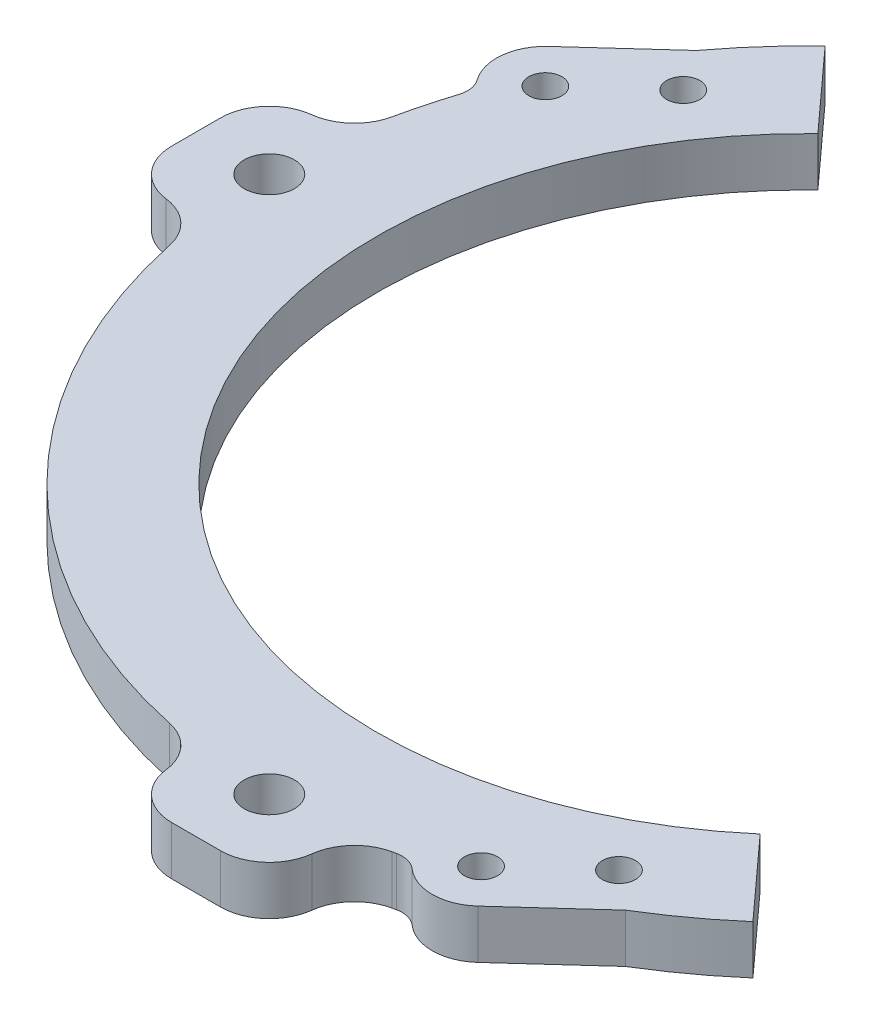
ISO-10303-21;
HEADER;
FILE_DESCRIPTION(('STEP AP214'),'2;1');
FILE_NAME('part.step','',(''),(''),'','','');
FILE_SCHEMA(('AUTOMOTIVE_DESIGN { 1 0 10303 214 1 1 1 1 }'));
ENDSEC;
DATA;
#1=APPLICATION_CONTEXT('core data for automotive mechanical design processes');
#2=APPLICATION_PROTOCOL_DEFINITION('international standard','automotive_design',2000,#1);
#3=PRODUCT_CONTEXT('',#1,'mechanical');
#4=PRODUCT('Part','Part','',(#3));
#5=PRODUCT_RELATED_PRODUCT_CATEGORY('part','',(#4));
#6=PRODUCT_DEFINITION_FORMATION('','',#4);
#7=PRODUCT_DEFINITION_CONTEXT('part definition',#1,'design');
#8=PRODUCT_DEFINITION('design','',#6,#7);
#9=PRODUCT_DEFINITION_SHAPE('','',#8);
#10=(LENGTH_UNIT() NAMED_UNIT(*) SI_UNIT(.MILLI.,.METRE.));
#11=(NAMED_UNIT(*) PLANE_ANGLE_UNIT() SI_UNIT($,.RADIAN.));
#12=(NAMED_UNIT(*) SI_UNIT($,.STERADIAN.) SOLID_ANGLE_UNIT());
#13=UNCERTAINTY_MEASURE_WITH_UNIT(LENGTH_MEASURE(1.E-05),#10,'distance_accuracy_value','');
#14=(GEOMETRIC_REPRESENTATION_CONTEXT(3) GLOBAL_UNCERTAINTY_ASSIGNED_CONTEXT((#13)) GLOBAL_UNIT_ASSIGNED_CONTEXT((#10,
#11,#12)) REPRESENTATION_CONTEXT('',''));
#15=CARTESIAN_POINT('',(0.,0.,0.));
#16=DIRECTION('',(0.,0.,1.));
#17=DIRECTION('',(1.,0.,0.));
#18=AXIS2_PLACEMENT_3D('',#15,#16,#17);
#19=CARTESIAN_POINT('',(0.,6.35,0.));
#20=DIRECTION('',(0.,1.,0.));
#21=DIRECTION('',(0.,0.,1.));
#22=AXIS2_PLACEMENT_3D('',#19,#20,#21);
#23=PLANE('',#22);
#24=CARTESIAN_POINT('',(31.274224331487,6.35,55.6401101119106));
#25=DIRECTION('',(0.,-1.,0.));
#26=DIRECTION('',(0.,0.,-1.));
#27=AXIS2_PLACEMENT_3D('',#24,#25,#26);
#28=CIRCLE('',#27,2.15265);
#29=CARTESIAN_POINT('',(31.274224331487,6.35,53.4874601119106));
#30=VERTEX_POINT('',#29);
#31=EDGE_CURVE('E736',#30,#30,#28,.T.);
#32=ORIENTED_EDGE('',*,*,#31,.T.);
#33=EDGE_LOOP('',(#32));
#34=FACE_BOUND('',#33,.T.);
#35=CARTESIAN_POINT('',(-61.814820817554,6.35,-27.8750674993873));
#36=DIRECTION('',(0.,-1.,0.));
#37=DIRECTION('',(0.,0.,-1.));
#38=AXIS2_PLACEMENT_3D('',#35,#36,#37);
#39=CIRCLE('',#38,2.15265);
#40=CARTESIAN_POINT('',(-61.814820817554,6.35,-30.0277174993873));
#41=VERTEX_POINT('',#40);
#42=EDGE_CURVE('E743',#41,#41,#39,.T.);
#43=ORIENTED_EDGE('',*,*,#42,.T.);
#44=EDGE_LOOP('',(#43));
#45=FACE_BOUND('',#44,.T.);
#46=CARTESIAN_POINT('',(-52.4177142064565,6.35,-36.4181575340099));
#47=DIRECTION('',(0.,-1.,0.));
#48=DIRECTION('',(0.,0.,-1.));
#49=AXIS2_PLACEMENT_3D('',#46,#47,#48);
#50=CIRCLE('',#49,2.15265);
#51=CARTESIAN_POINT('',(-52.4177142064565,6.35,-38.5708075340099));
#52=VERTEX_POINT('',#51);
#53=EDGE_CURVE('E210',#52,#52,#50,.T.);
#54=ORIENTED_EDGE('',*,*,#53,.T.);
#55=EDGE_LOOP('',(#54));
#56=FACE_BOUND('',#55,.T.);
#57=CARTESIAN_POINT('',(0.,6.35,0.));
#58=DIRECTION('',(0.,1.,0.));
#59=DIRECTION('',(0.,0.,1.));
#60=AXIS2_PLACEMENT_3D('',#57,#58,#59);
#61=CIRCLE('',#60,69.85);
#62=CARTESIAN_POINT('',(14.4681299077741,6.35,68.3351718880678));
#63=VERTEX_POINT('',#62);
#64=CARTESIAN_POINT('',(14.9147795723539,6.35,68.2390786156151));
#65=VERTEX_POINT('',#64);
#66=EDGE_CURVE('E419',#63,#65,#61,.T.);
#67=ORIENTED_EDGE('',*,*,#66,.T.);
#68=CARTESIAN_POINT('',(15.59272409837,6.35,71.3408549163249));
#69=DIRECTION('',(0.,1.,0.));
#70=DIRECTION('',(0.,0.,1.));
#71=AXIS2_PLACEMENT_3D('',#68,#69,#70);
#72=CIRCLE('',#71,3.175);
#73=CARTESIAN_POINT('',(17.6875219723765,6.35,68.9549699930609));
#74=VERTEX_POINT('',#73);
#75=EDGE_CURVE('E443',#65,#74,#72,.F.);
#76=ORIENTED_EDGE('',*,*,#75,.T.);
#77=CARTESIAN_POINT('',(21.8771177203895,6.35,64.1832001465331));
#78=DIRECTION('',(0.,1.,0.));
#79=DIRECTION('',(0.,0.,1.));
#80=AXIS2_PLACEMENT_3D('',#77,#78,#79);
#81=CIRCLE('',#80,6.35000000000001);
#82=CARTESIAN_POINT('',(26.1486627377007,6.35,68.8817534520819));
#83=VERTEX_POINT('',#82);
#84=EDGE_CURVE('E221',#83,#74,#81,.F.);
#85=ORIENTED_EDGE('',*,*,#84,.F.);
#86=DIRECTION('',(-0.739929654417129,0.,0.672684254694689));
#87=VECTOR('',#86,1.);
#88=CARTESIAN_POINT('',(44.9428759598958,6.35,51.7955733828368));
#89=LINE('',#88,#87);
#90=CARTESIAN_POINT('',(36.2207197765855,6.35,59.7250530252261));
#91=VERTEX_POINT('',#90);
#92=EDGE_CURVE('E216',#91,#83,#89,.T.);
#93=ORIENTED_EDGE('',*,*,#92,.F.);
#94=CARTESIAN_POINT('',(45.8002202255313,6.35,52.7386227284411));
#95=VERTEX_POINT('',#94);
#96=EDGE_CURVE('E456',#91,#95,#61,.T.);
#97=ORIENTED_EDGE('',*,*,#96,.T.);
#98=DIRECTION('',(0.672684254694688,0.,0.739929654417129));
#99=VECTOR('',#98,1.);
#100=CARTESIAN_POINT('',(-57.4966353212064,6.35,-60.884382557693));
#101=LINE('',#100,#99);
#102=CARTESIAN_POINT('',(36.3997859252733,6.35,42.3984667717393));
#103=VERTEX_POINT('',#102);
#104=EDGE_CURVE('E406',#103,#95,#101,.T.);
#105=ORIENTED_EDGE('',*,*,#104,.F.);
#106=CARTESIAN_POINT('',(0.,6.35,0.));
#107=DIRECTION('',(0.,1.,0.));
#108=DIRECTION('',(0.,0.,1.));
#109=AXIS2_PLACEMENT_3D('',#106,#107,#108);
#110=CIRCLE('',#109,55.88);
#111=CARTESIAN_POINT('',(-38.7490625780477,6.35,-40.2626942630836));
#112=VERTEX_POINT('',#111);
#113=EDGE_CURVE('E265',#112,#103,#110,.T.);
#114=ORIENTED_EDGE('',*,*,#113,.F.);
#115=CARTESIAN_POINT('',(-48.1494968783056,6.35,-50.6028502197854));
#116=VERTEX_POINT('',#115);
#117=EDGE_CURVE('E407',#116,#112,#101,.T.);
#118=ORIENTED_EDGE('',*,*,#117,.F.);
#119=CARTESIAN_POINT('',(-56.0143087959805,6.35,-41.7303212317919));
#120=VERTEX_POINT('',#119);
#121=EDGE_CURVE('E321',#116,#120,#61,.T.);
#122=ORIENTED_EDGE('',*,*,#121,.T.);
#123=DIRECTION('',(0.739929654417129,0.,-0.672684254694689));
#124=VECTOR('',#123,1.);
#125=CARTESIAN_POINT('',(-47.2921526126702,6.35,-49.6598008741811));
#126=LINE('',#125,#124);
#127=CARTESIAN_POINT('',(-66.0863658348653,6.35,-32.573620804936));
#128=VERTEX_POINT('',#127);
#129=EDGE_CURVE('E246',#128,#120,#126,.T.);
#130=ORIENTED_EDGE('',*,*,#129,.F.);
#131=CARTESIAN_POINT('',(-61.814820817554,6.35,-27.8750674993873));
#132=DIRECTION('',(0.,1.,0.));
#133=DIRECTION('',(0.,0.,1.));
#134=AXIS2_PLACEMENT_3D('',#131,#132,#133);
#135=CIRCLE('',#134,6.35);
#136=CARTESIAN_POINT('',(-66.9629901758792,6.35,-24.1576958125632));
#137=VERTEX_POINT('',#136);
#138=EDGE_CURVE('E242',#137,#128,#135,.F.);
#139=ORIENTED_EDGE('',*,*,#138,.F.);
#140=CARTESIAN_POINT('',(-69.5370748550419,6.35,-22.2990099691511));
#141=DIRECTION('',(0.,1.,0.));
#142=DIRECTION('',(0.,0.,1.));
#143=AXIS2_PLACEMENT_3D('',#140,#141,#142);
#144=CIRCLE('',#143,3.175);
#145=CARTESIAN_POINT('',(-66.5137237743879,6.35,-21.3294877965793));
#146=VERTEX_POINT('',#145);
#147=EDGE_CURVE('E11',#137,#146,#144,.F.);
#148=ORIENTED_EDGE('',*,*,#147,.T.);
#149=CARTESIAN_POINT('',(-68.3351718880678,6.35,-14.4681299077739));
#150=VERTEX_POINT('',#149);
#151=EDGE_CURVE('E418',#146,#150,#61,.T.);
#152=ORIENTED_EDGE('',*,*,#151,.T.);
#153=CARTESIAN_POINT('',(-74.5474602415285,6.35,-15.7834144448442));
#154=DIRECTION('',(0.,1.,0.));
#155=DIRECTION('',(0.,0.,1.));
#156=AXIS2_PLACEMENT_3D('',#153,#154,#155);
#157=CIRCLE('',#156,6.35);
#158=CARTESIAN_POINT('',(-73.7862301207643,6.35,-9.47920722242202));
#159=VERTEX_POINT('',#158);
#160=EDGE_CURVE('E317',#150,#159,#157,.F.);
#161=ORIENTED_EDGE('',*,*,#160,.T.);
#162=CARTESIAN_POINT('',(-73.025,6.35,-3.17499999999975));
#163=DIRECTION('',(0.,1.,0.));
#164=DIRECTION('',(-1.,0.,0.));
#165=AXIS2_PLACEMENT_3D('',#162,#163,#164);
#166=CIRCLE('',#165,6.35);
#167=CARTESIAN_POINT('',(-79.375,6.35,-3.17499999999968));
#168=VERTEX_POINT('',#167);
#169=EDGE_CURVE('E320',#159,#168,#166,.T.);
#170=ORIENTED_EDGE('',*,*,#169,.T.);
#171=DIRECTION('',(0.,0.,1.));
#172=VECTOR('',#171,1.);
#173=CARTESIAN_POINT('',(-79.375,6.35,3.17500000000023));
#174=LINE('',#173,#172);
#175=CARTESIAN_POINT('',(-79.375,6.35,3.17500000000023));
#176=VERTEX_POINT('',#175);
#177=EDGE_CURVE('E349',#168,#176,#174,.T.);
#178=ORIENTED_EDGE('',*,*,#177,.T.);
#179=CARTESIAN_POINT('',(-73.025,6.35,3.17500000000026));
#180=DIRECTION('',(0.,1.,0.));
#181=DIRECTION('',(-1.,0.,0.));
#182=AXIS2_PLACEMENT_3D('',#179,#180,#181);
#183=CIRCLE('',#182,6.35);
#184=CARTESIAN_POINT('',(-73.7862301207642,6.35,9.47920722242253));
#185=VERTEX_POINT('',#184);
#186=EDGE_CURVE('E309',#176,#185,#183,.T.);
#187=ORIENTED_EDGE('',*,*,#186,.T.);
#188=CARTESIAN_POINT('',(-74.5474602415284,6.35,15.7834144448448));
#189=DIRECTION('',(0.,1.,0.));
#190=DIRECTION('',(0.,0.,1.));
#191=AXIS2_PLACEMENT_3D('',#188,#189,#190);
#192=CIRCLE('',#191,6.35);
#193=CARTESIAN_POINT('',(-68.3351718880677,6.35,14.4681299077744));
#194=VERTEX_POINT('',#193);
#195=EDGE_CURVE('E306',#185,#194,#192,.F.);
#196=ORIENTED_EDGE('',*,*,#195,.T.);
#197=CARTESIAN_POINT('',(-14.4681299077741,6.35,68.3351718880678));
#198=VERTEX_POINT('',#197);
#199=EDGE_CURVE('E287',#194,#198,#61,.T.);
#200=ORIENTED_EDGE('',*,*,#199,.T.);
#201=CARTESIAN_POINT('',(-15.7834144448445,6.35,74.5474602415285));
#202=DIRECTION('',(0.,1.,0.));
#203=DIRECTION('',(0.,0.,1.));
#204=AXIS2_PLACEMENT_3D('',#201,#202,#203);
#205=CIRCLE('',#204,6.35);
#206=CARTESIAN_POINT('',(-9.47920722242228,6.35,73.7862301207643));
#207=VERTEX_POINT('',#206);
#208=EDGE_CURVE('E283',#198,#207,#205,.F.);
#209=ORIENTED_EDGE('',*,*,#208,.T.);
#210=CARTESIAN_POINT('',(-3.175,6.35,73.025));
#211=DIRECTION('',(0.,1.,0.));
#212=DIRECTION('',(0.,0.,1.));
#213=AXIS2_PLACEMENT_3D('',#210,#211,#212);
#214=CIRCLE('',#213,6.35);
#215=CARTESIAN_POINT('',(-3.17499999999996,6.35,79.375));
#216=VERTEX_POINT('',#215);
#217=EDGE_CURVE('E286',#207,#216,#214,.T.);
#218=ORIENTED_EDGE('',*,*,#217,.T.);
#219=DIRECTION('',(1.,0.,0.));
#220=VECTOR('',#219,1.);
#221=CARTESIAN_POINT('',(3.17499999999996,6.35,79.375));
#222=LINE('',#221,#220);
#223=CARTESIAN_POINT('',(3.17499999999996,6.35,79.375));
#224=VERTEX_POINT('',#223);
#225=EDGE_CURVE('E373',#216,#224,#222,.T.);
#226=ORIENTED_EDGE('',*,*,#225,.T.);
#227=CARTESIAN_POINT('',(3.175,6.35,73.025));
#228=DIRECTION('',(0.,1.,0.));
#229=DIRECTION('',(0.,0.,1.));
#230=AXIS2_PLACEMENT_3D('',#227,#228,#229);
#231=CIRCLE('',#230,6.35);
#232=CARTESIAN_POINT('',(9.47920722242228,6.35,73.7862301207643));
#233=VERTEX_POINT('',#232);
#234=EDGE_CURVE('E274',#224,#233,#231,.T.);
#235=ORIENTED_EDGE('',*,*,#234,.T.);
#236=CARTESIAN_POINT('',(15.7834144448445,6.35,74.5474602415285));
#237=DIRECTION('',(0.,1.,0.));
#238=DIRECTION('',(0.,0.,1.));
#239=AXIS2_PLACEMENT_3D('',#236,#237,#238);
#240=CIRCLE('',#239,6.35);
#241=EDGE_CURVE('E270',#233,#63,#240,.F.);
#242=ORIENTED_EDGE('',*,*,#241,.T.);
#243=EDGE_LOOP('',(#67,#76,#85,#93,#97,#105,#114,#118,#122,#130,#139,#148,#152,#161,#170,#178,
#187,#196,#200,#209,#218,#226,#235,#242));
#244=FACE_BOUND('',#243,.T.);
#245=CARTESIAN_POINT('',(-2.43879971518193E-13,6.35,69.85));
#246=DIRECTION('',(0.,1.,0.));
#247=DIRECTION('',(0.,0.,1.));
#248=AXIS2_PLACEMENT_3D('',#245,#246,#247);
#249=CIRCLE('',#248,3.2639);
#250=CARTESIAN_POINT('',(-2.43879971518193E-13,6.35,73.1139));
#251=VERTEX_POINT('',#250);
#252=EDGE_CURVE('E367',#251,#251,#249,.T.);
#253=ORIENTED_EDGE('',*,*,#252,.F.);
#254=EDGE_LOOP('',(#253));
#255=FACE_BOUND('',#254,.T.);
#256=CARTESIAN_POINT('',(-69.85,6.35,0.));
#257=DIRECTION('',(0.,1.,0.));
#258=DIRECTION('',(0.,0.,1.));
#259=AXIS2_PLACEMENT_3D('',#256,#257,#258);
#260=CIRCLE('',#259,3.2639);
#261=CARTESIAN_POINT('',(-69.85,6.35,3.2639));
#262=VERTEX_POINT('',#261);
#263=EDGE_CURVE('E394',#262,#262,#260,.T.);
#264=ORIENTED_EDGE('',*,*,#263,.F.);
#265=EDGE_LOOP('',(#264));
#266=FACE_BOUND('',#265,.T.);
#267=CARTESIAN_POINT('',(21.8771177203894,6.35,64.1832001465331));
#268=DIRECTION('',(0.,-1.,0.));
#269=DIRECTION('',(0.,0.,-1.));
#270=AXIS2_PLACEMENT_3D('',#267,#268,#269);
#271=CIRCLE('',#270,2.15265);
#272=CARTESIAN_POINT('',(21.8771177203894,6.35,62.0305501465331));
#273=VERTEX_POINT('',#272);
#274=EDGE_CURVE('E722',#273,#273,#271,.T.);
#275=ORIENTED_EDGE('',*,*,#274,.T.);
#276=EDGE_LOOP('',(#275));
#277=FACE_BOUND('',#276,.T.);
#278=ADVANCED_FACE('F39',(#34,#45,#56,#244,#255,#266,#277),#23,.T.);
#279=CARTESIAN_POINT('',(0.,0.,0.));
#280=DIRECTION('',(0.,1.,0.));
#281=DIRECTION('',(0.,0.,1.));
#282=AXIS2_PLACEMENT_3D('',#279,#280,#281);
#283=PLANE('',#282);
#284=CARTESIAN_POINT('',(31.274224331487,0.,55.6401101119106));
#285=DIRECTION('',(0.,-1.,0.));
#286=DIRECTION('',(0.,0.,-1.));
#287=AXIS2_PLACEMENT_3D('',#284,#285,#286);
#288=CIRCLE('',#287,2.15265);
#289=CARTESIAN_POINT('',(31.274224331487,0.,53.4874601119106));
#290=VERTEX_POINT('',#289);
#291=EDGE_CURVE('E730',#290,#290,#288,.T.);
#292=ORIENTED_EDGE('',*,*,#291,.F.);
#293=EDGE_LOOP('',(#292));
#294=FACE_BOUND('',#293,.T.);
#295=CARTESIAN_POINT('',(-61.814820817554,0.,-27.8750674993873));
#296=DIRECTION('',(0.,-1.,0.));
#297=DIRECTION('',(0.,0.,-1.));
#298=AXIS2_PLACEMENT_3D('',#295,#296,#297);
#299=CIRCLE('',#298,2.15265);
#300=CARTESIAN_POINT('',(-61.814820817554,0.,-30.0277174993873));
#301=VERTEX_POINT('',#300);
#302=EDGE_CURVE('E739',#301,#301,#299,.T.);
#303=ORIENTED_EDGE('',*,*,#302,.F.);
#304=EDGE_LOOP('',(#303));
#305=FACE_BOUND('',#304,.T.);
#306=CARTESIAN_POINT('',(0.,0.,0.));
#307=DIRECTION('',(0.,1.,0.));
#308=DIRECTION('',(0.,0.,1.));
#309=AXIS2_PLACEMENT_3D('',#306,#307,#308);
#310=CIRCLE('',#309,69.85);
#311=CARTESIAN_POINT('',(36.2207197765855,0.,59.7250530252261));
#312=VERTEX_POINT('',#311);
#313=CARTESIAN_POINT('',(45.8002202255313,0.,52.7386227284411));
#314=VERTEX_POINT('',#313);
#315=EDGE_CURVE('E206',#312,#314,#310,.T.);
#316=ORIENTED_EDGE('',*,*,#315,.F.);
#317=DIRECTION('',(-0.739929654417129,0.,0.672684254694689));
#318=VECTOR('',#317,1.);
#319=CARTESIAN_POINT('',(44.9428759598958,0.,51.7955733828368));
#320=LINE('',#319,#318);
#321=CARTESIAN_POINT('',(26.1486627377007,0.,68.8817534520819));
#322=VERTEX_POINT('',#321);
#323=EDGE_CURVE('E198',#312,#322,#320,.T.);
#324=ORIENTED_EDGE('',*,*,#323,.T.);
#325=CARTESIAN_POINT('',(21.8771177203895,0.,64.1832001465331));
#326=DIRECTION('',(0.,-1.,0.));
#327=DIRECTION('',(0.,0.,-1.));
#328=AXIS2_PLACEMENT_3D('',#325,#326,#327);
#329=CIRCLE('',#328,6.35000000000001);
#330=CARTESIAN_POINT('',(17.6875219723765,0.,68.9549699930609));
#331=VERTEX_POINT('',#330);
#332=EDGE_CURVE('E203',#322,#331,#329,.T.);
#333=ORIENTED_EDGE('',*,*,#332,.T.);
#334=CARTESIAN_POINT('',(15.59272409837,0.,71.3408549163249));
#335=DIRECTION('',(0.,1.,0.));
#336=DIRECTION('',(0.,0.,1.));
#337=AXIS2_PLACEMENT_3D('',#334,#335,#336);
#338=CIRCLE('',#337,3.175);
#339=CARTESIAN_POINT('',(14.9147795723539,0.,68.2390786156151));
#340=VERTEX_POINT('',#339);
#341=EDGE_CURVE('E446',#331,#340,#338,.T.);
#342=ORIENTED_EDGE('',*,*,#341,.T.);
#343=CARTESIAN_POINT('',(14.4681299077741,0.,68.3351718880678));
#344=VERTEX_POINT('',#343);
#345=EDGE_CURVE('E424',#344,#340,#310,.T.);
#346=ORIENTED_EDGE('',*,*,#345,.F.);
#347=CARTESIAN_POINT('',(15.7834144448445,0.,74.5474602415285));
#348=DIRECTION('',(0.,1.,0.));
#349=DIRECTION('',(0.,0.,1.));
#350=AXIS2_PLACEMENT_3D('',#347,#348,#349);
#351=CIRCLE('',#350,6.35);
#352=CARTESIAN_POINT('',(9.47920722242228,0.,73.7862301207643));
#353=VERTEX_POINT('',#352);
#354=EDGE_CURVE('E275',#344,#353,#351,.T.);
#355=ORIENTED_EDGE('',*,*,#354,.T.);
#356=CARTESIAN_POINT('',(3.175,0.,73.025));
#357=DIRECTION('',(0.,1.,0.));
#358=DIRECTION('',(0.,0.,1.));
#359=AXIS2_PLACEMENT_3D('',#356,#357,#358);
#360=CIRCLE('',#359,6.35);
#361=CARTESIAN_POINT('',(3.17499999999996,0.,79.375));
#362=VERTEX_POINT('',#361);
#363=EDGE_CURVE('E292',#362,#353,#360,.T.);
#364=ORIENTED_EDGE('',*,*,#363,.F.);
#365=DIRECTION('',(1.,0.,0.));
#366=VECTOR('',#365,1.);
#367=CARTESIAN_POINT('',(3.17499999999996,0.,79.375));
#368=LINE('',#367,#366);
#369=CARTESIAN_POINT('',(-3.17499999999996,0.,79.375));
#370=VERTEX_POINT('',#369);
#371=EDGE_CURVE('E291',#370,#362,#368,.T.);
#372=ORIENTED_EDGE('',*,*,#371,.F.);
#373=CARTESIAN_POINT('',(-3.175,0.,73.025));
#374=DIRECTION('',(0.,1.,0.));
#375=DIRECTION('',(0.,0.,1.));
#376=AXIS2_PLACEMENT_3D('',#373,#374,#375);
#377=CIRCLE('',#376,6.35);
#378=CARTESIAN_POINT('',(-9.47920722242228,0.,73.7862301207643));
#379=VERTEX_POINT('',#378);
#380=EDGE_CURVE('E299',#379,#370,#377,.T.);
#381=ORIENTED_EDGE('',*,*,#380,.F.);
#382=CARTESIAN_POINT('',(-15.7834144448445,0.,74.5474602415285));
#383=DIRECTION('',(0.,1.,0.));
#384=DIRECTION('',(0.,0.,1.));
#385=AXIS2_PLACEMENT_3D('',#382,#383,#384);
#386=CIRCLE('',#385,6.35);
#387=CARTESIAN_POINT('',(-14.4681299077741,0.,68.3351718880678));
#388=VERTEX_POINT('',#387);
#389=EDGE_CURVE('E278',#379,#388,#386,.T.);
#390=ORIENTED_EDGE('',*,*,#389,.T.);
#391=CARTESIAN_POINT('',(-68.3351718880677,0.,14.4681299077744));
#392=VERTEX_POINT('',#391);
#393=EDGE_CURVE('E269',#392,#388,#310,.T.);
#394=ORIENTED_EDGE('',*,*,#393,.F.);
#395=CARTESIAN_POINT('',(-74.5474602415284,0.,15.7834144448448));
#396=DIRECTION('',(0.,1.,0.));
#397=DIRECTION('',(0.,0.,1.));
#398=AXIS2_PLACEMENT_3D('',#395,#396,#397);
#399=CIRCLE('',#398,6.35);
#400=CARTESIAN_POINT('',(-73.7862301207642,0.,9.47920722242253));
#401=VERTEX_POINT('',#400);
#402=EDGE_CURVE('E282',#392,#401,#399,.T.);
#403=ORIENTED_EDGE('',*,*,#402,.T.);
#404=CARTESIAN_POINT('',(-73.025,0.,3.17500000000026));
#405=DIRECTION('',(0.,1.,0.));
#406=DIRECTION('',(-1.,0.,0.));
#407=AXIS2_PLACEMENT_3D('',#404,#405,#406);
#408=CIRCLE('',#407,6.35);
#409=CARTESIAN_POINT('',(-79.375,0.,3.17500000000023));
#410=VERTEX_POINT('',#409);
#411=EDGE_CURVE('E326',#410,#401,#408,.T.);
#412=ORIENTED_EDGE('',*,*,#411,.F.);
#413=DIRECTION('',(0.,0.,1.));
#414=VECTOR('',#413,1.);
#415=CARTESIAN_POINT('',(-79.375,0.,3.17500000000023));
#416=LINE('',#415,#414);
#417=CARTESIAN_POINT('',(-79.375,0.,-3.17499999999968));
#418=VERTEX_POINT('',#417);
#419=EDGE_CURVE('E325',#418,#410,#416,.T.);
#420=ORIENTED_EDGE('',*,*,#419,.F.);
#421=CARTESIAN_POINT('',(-73.025,0.,-3.17499999999975));
#422=DIRECTION('',(0.,1.,0.));
#423=DIRECTION('',(-1.,0.,0.));
#424=AXIS2_PLACEMENT_3D('',#421,#422,#423);
#425=CIRCLE('',#424,6.35);
#426=CARTESIAN_POINT('',(-73.7862301207643,0.,-9.47920722242202));
#427=VERTEX_POINT('',#426);
#428=EDGE_CURVE('E333',#427,#418,#425,.T.);
#429=ORIENTED_EDGE('',*,*,#428,.F.);
#430=CARTESIAN_POINT('',(-74.5474602415285,0.,-15.7834144448442));
#431=DIRECTION('',(0.,1.,0.));
#432=DIRECTION('',(0.,0.,1.));
#433=AXIS2_PLACEMENT_3D('',#430,#431,#432);
#434=CIRCLE('',#433,6.35);
#435=CARTESIAN_POINT('',(-68.3351718880678,0.,-14.4681299077739));
#436=VERTEX_POINT('',#435);
#437=EDGE_CURVE('E312',#427,#436,#434,.T.);
#438=ORIENTED_EDGE('',*,*,#437,.T.);
#439=CARTESIAN_POINT('',(-66.5137237743879,0.,-21.3294877965793));
#440=VERTEX_POINT('',#439);
#441=EDGE_CURVE('E423',#440,#436,#310,.T.);
#442=ORIENTED_EDGE('',*,*,#441,.F.);
#443=CARTESIAN_POINT('',(-69.5370748550419,0.,-22.2990099691511));
#444=DIRECTION('',(0.,1.,0.));
#445=DIRECTION('',(0.,0.,1.));
#446=AXIS2_PLACEMENT_3D('',#443,#444,#445);
#447=CIRCLE('',#446,3.175);
#448=CARTESIAN_POINT('',(-66.9629901758792,0.,-24.1576958125632));
#449=VERTEX_POINT('',#448);
#450=EDGE_CURVE('E48',#440,#449,#447,.T.);
#451=ORIENTED_EDGE('',*,*,#450,.T.);
#452=CARTESIAN_POINT('',(-61.814820817554,0.,-27.8750674993873));
#453=DIRECTION('',(0.,-1.,0.));
#454=DIRECTION('',(0.,0.,1.));
#455=AXIS2_PLACEMENT_3D('',#452,#453,#454);
#456=CIRCLE('',#455,6.35);
#457=CARTESIAN_POINT('',(-66.0863658348653,0.,-32.5736208049361));
#458=VERTEX_POINT('',#457);
#459=EDGE_CURVE('E239',#449,#458,#456,.T.);
#460=ORIENTED_EDGE('',*,*,#459,.T.);
#461=DIRECTION('',(0.739929654417129,0.,-0.672684254694689));
#462=VECTOR('',#461,1.);
#463=CARTESIAN_POINT('',(-47.2921526126702,0.,-49.6598008741811));
#464=LINE('',#463,#462);
#465=CARTESIAN_POINT('',(-56.0143087959805,0.,-41.7303212317919));
#466=VERTEX_POINT('',#465);
#467=EDGE_CURVE('E238',#458,#466,#464,.T.);
#468=ORIENTED_EDGE('',*,*,#467,.T.);
#469=CARTESIAN_POINT('',(-48.1494968783056,0.,-50.6028502197854));
#470=VERTEX_POINT('',#469);
#471=EDGE_CURVE('E339',#470,#466,#310,.T.);
#472=ORIENTED_EDGE('',*,*,#471,.F.);
#473=DIRECTION('',(0.672684254694688,0.,0.739929654417129));
#474=VECTOR('',#473,1.);
#475=CARTESIAN_POINT('',(-57.4966353212064,0.,-60.884382557693));
#476=LINE('',#475,#474);
#477=CARTESIAN_POINT('',(-38.7490625780477,0.,-40.2626942630836));
#478=VERTEX_POINT('',#477);
#479=EDGE_CURVE('E316',#470,#478,#476,.T.);
#480=ORIENTED_EDGE('',*,*,#479,.T.);
#481=CARTESIAN_POINT('',(0.,0.,0.));
#482=DIRECTION('',(0.,1.,0.));
#483=DIRECTION('',(0.,0.,1.));
#484=AXIS2_PLACEMENT_3D('',#481,#482,#483);
#485=CIRCLE('',#484,55.88);
#486=CARTESIAN_POINT('',(36.3997859252733,0.,42.3984667717393));
#487=VERTEX_POINT('',#486);
#488=EDGE_CURVE('E428',#478,#487,#485,.T.);
#489=ORIENTED_EDGE('',*,*,#488,.T.);
#490=EDGE_CURVE('E279',#487,#314,#476,.T.);
#491=ORIENTED_EDGE('',*,*,#490,.T.);
#492=EDGE_LOOP('',(#316,#324,#333,#342,#346,#355,#364,#372,#381,#390,#394,#403,#412,#420,#429,
#438,#442,#451,#460,#468,#472,#480,#489,#491));
#493=FACE_BOUND('',#492,.T.);
#494=CARTESIAN_POINT('',(-69.85,0.,0.));
#495=DIRECTION('',(0.,1.,0.));
#496=DIRECTION('',(0.,0.,1.));
#497=AXIS2_PLACEMENT_3D('',#494,#495,#496);
#498=CIRCLE('',#497,3.2639);
#499=CARTESIAN_POINT('',(-69.85,0.,3.2639));
#500=VERTEX_POINT('',#499);
#501=EDGE_CURVE('E390',#500,#500,#498,.T.);
#502=ORIENTED_EDGE('',*,*,#501,.T.);
#503=EDGE_LOOP('',(#502));
#504=FACE_BOUND('',#503,.T.);
#505=CARTESIAN_POINT('',(-2.43879971518193E-13,0.,69.85));
#506=DIRECTION('',(0.,1.,0.));
#507=DIRECTION('',(0.,0.,1.));
#508=AXIS2_PLACEMENT_3D('',#505,#506,#507);
#509=CIRCLE('',#508,3.2639);
#510=CARTESIAN_POINT('',(-2.43879971518193E-13,0.,73.1139));
#511=VERTEX_POINT('',#510);
#512=EDGE_CURVE('E273',#511,#511,#509,.T.);
#513=ORIENTED_EDGE('',*,*,#512,.T.);
#514=EDGE_LOOP('',(#513));
#515=FACE_BOUND('',#514,.T.);
#516=CARTESIAN_POINT('',(-52.4177142064565,0.,-36.4181575340099));
#517=DIRECTION('',(0.,-1.,0.));
#518=DIRECTION('',(0.,0.,-1.));
#519=AXIS2_PLACEMENT_3D('',#516,#517,#518);
#520=CIRCLE('',#519,2.15265);
#521=CARTESIAN_POINT('',(-52.4177142064565,0.,-38.5708075340099));
#522=VERTEX_POINT('',#521);
#523=EDGE_CURVE('E746',#522,#522,#520,.T.);
#524=ORIENTED_EDGE('',*,*,#523,.F.);
#525=EDGE_LOOP('',(#524));
#526=FACE_BOUND('',#525,.T.);
#527=CARTESIAN_POINT('',(21.8771177203894,0.,64.1832001465331));
#528=DIRECTION('',(0.,-1.,0.));
#529=DIRECTION('',(0.,0.,-1.));
#530=AXIS2_PLACEMENT_3D('',#527,#528,#529);
#531=CIRCLE('',#530,2.15265);
#532=CARTESIAN_POINT('',(21.8771177203894,0.,62.0305501465331));
#533=VERTEX_POINT('',#532);
#534=EDGE_CURVE('E725',#533,#533,#531,.T.);
#535=ORIENTED_EDGE('',*,*,#534,.F.);
#536=EDGE_LOOP('',(#535));
#537=FACE_BOUND('',#536,.T.);
#538=ADVANCED_FACE('F200',(#294,#305,#493,#504,#515,#526,#537),#283,.F.);
#539=CARTESIAN_POINT('',(0.,6.35,0.));
#540=DIRECTION('',(0.,-1.,0.));
#541=DIRECTION('',(0.,0.,-1.));
#542=AXIS2_PLACEMENT_3D('',#539,#540,#541);
#543=CYLINDRICAL_SURFACE('',#542,69.85);
#544=ORIENTED_EDGE('',*,*,#96,.F.);
#545=DIRECTION('',(0.,-1.,0.));
#546=VECTOR('',#545,1.);
#547=CARTESIAN_POINT('',(36.2207197765855,6.35,59.7250530252261));
#548=LINE('',#547,#546);
#549=EDGE_CURVE('E234',#91,#312,#548,.T.);
#550=ORIENTED_EDGE('',*,*,#549,.T.);
#551=ORIENTED_EDGE('',*,*,#315,.T.);
#552=DIRECTION('',(0.,-1.,0.));
#553=VECTOR('',#552,1.);
#554=CARTESIAN_POINT('',(45.8002202255312,6.35,52.7386227284411));
#555=LINE('',#554,#553);
#556=EDGE_CURVE('E402',#95,#314,#555,.T.);
#557=ORIENTED_EDGE('',*,*,#556,.F.);
#558=EDGE_LOOP('',(#544,#550,#551,#557));
#559=FACE_BOUND('',#558,.T.);
#560=ADVANCED_FACE('F468',(#559),#543,.T.);
#561=ORIENTED_EDGE('',*,*,#151,.F.);
#562=DIRECTION('',(0.,-1.,0.));
#563=VECTOR('',#562,1.);
#564=CARTESIAN_POINT('',(-66.5137237743879,6.35,-21.3294877965793));
#565=LINE('',#564,#563);
#566=EDGE_CURVE('E437',#146,#440,#565,.T.);
#567=ORIENTED_EDGE('',*,*,#566,.T.);
#568=ORIENTED_EDGE('',*,*,#441,.T.);
#569=DIRECTION('',(0.,-1.,0.));
#570=VECTOR('',#569,1.);
#571=CARTESIAN_POINT('',(-68.3351718880679,6.35,-14.4681299077739));
#572=LINE('',#571,#570);
#573=EDGE_CURVE('E335',#436,#150,#572,.F.);
#574=ORIENTED_EDGE('',*,*,#573,.T.);
#575=EDGE_LOOP('',(#561,#567,#568,#574));
#576=FACE_BOUND('',#575,.T.);
#577=ADVANCED_FACE('F532',(#576),#543,.T.);
#578=ORIENTED_EDGE('',*,*,#345,.T.);
#579=DIRECTION('',(0.,-1.,0.));
#580=VECTOR('',#579,1.);
#581=CARTESIAN_POINT('',(14.9147795723539,6.35,68.2390786156151));
#582=LINE('',#581,#580);
#583=EDGE_CURVE('E414',#340,#65,#582,.F.);
#584=ORIENTED_EDGE('',*,*,#583,.T.);
#585=ORIENTED_EDGE('',*,*,#66,.F.);
#586=DIRECTION('',(0.,-1.,0.));
#587=VECTOR('',#586,1.);
#588=CARTESIAN_POINT('',(14.4681299077741,6.35,68.3351718880678));
#589=LINE('',#588,#587);
#590=EDGE_CURVE('E259',#63,#344,#589,.T.);
#591=ORIENTED_EDGE('',*,*,#590,.T.);
#592=EDGE_LOOP('',(#578,#584,#585,#591));
#593=FACE_BOUND('',#592,.T.);
#594=ADVANCED_FACE('F480',(#593),#543,.T.);
#595=ORIENTED_EDGE('',*,*,#471,.T.);
#596=DIRECTION('',(0.,-1.,0.));
#597=VECTOR('',#596,1.);
#598=CARTESIAN_POINT('',(-56.0143087959805,6.35,-41.7303212317919));
#599=LINE('',#598,#597);
#600=EDGE_CURVE('E249',#466,#120,#599,.F.);
#601=ORIENTED_EDGE('',*,*,#600,.T.);
#602=ORIENTED_EDGE('',*,*,#121,.F.);
#603=DIRECTION('',(0.,-1.,0.));
#604=VECTOR('',#603,1.);
#605=CARTESIAN_POINT('',(-48.1494968783056,6.35,-50.6028502197854));
#606=LINE('',#605,#604);
#607=EDGE_CURVE('E401',#470,#116,#606,.F.);
#608=ORIENTED_EDGE('',*,*,#607,.F.);
#609=EDGE_LOOP('',(#595,#601,#602,#608));
#610=FACE_BOUND('',#609,.T.);
#611=ADVANCED_FACE('F545',(#610),#543,.T.);
#612=CARTESIAN_POINT('',(0.,6.35,0.));
#613=DIRECTION('',(0.,-1.,0.));
#614=DIRECTION('',(0.,0.,-1.));
#615=AXIS2_PLACEMENT_3D('',#612,#613,#614);
#616=CYLINDRICAL_SURFACE('',#615,55.88);
#617=ORIENTED_EDGE('',*,*,#113,.T.);
#618=DIRECTION('',(0.,-1.,0.));
#619=VECTOR('',#618,1.);
#620=CARTESIAN_POINT('',(36.3997859252733,6.35,42.3984667717393));
#621=LINE('',#620,#619);
#622=EDGE_CURVE('E260',#103,#487,#621,.T.);
#623=ORIENTED_EDGE('',*,*,#622,.T.);
#624=ORIENTED_EDGE('',*,*,#488,.F.);
#625=DIRECTION('',(0.,-1.,0.));
#626=VECTOR('',#625,1.);
#627=CARTESIAN_POINT('',(-38.7490625780476,6.35,-40.2626942630836));
#628=LINE('',#627,#626);
#629=EDGE_CURVE('E264',#478,#112,#628,.F.);
#630=ORIENTED_EDGE('',*,*,#629,.T.);
#631=EDGE_LOOP('',(#617,#623,#624,#630));
#632=FACE_BOUND('',#631,.T.);
#633=ADVANCED_FACE('F552',(#632),#616,.F.);
#634=ORIENTED_EDGE('',*,*,#393,.T.);
#635=DIRECTION('',(0.,-1.,0.));
#636=VECTOR('',#635,1.);
#637=CARTESIAN_POINT('',(-14.4681299077741,6.35,68.3351718880678));
#638=LINE('',#637,#636);
#639=EDGE_CURVE('E301',#388,#198,#638,.F.);
#640=ORIENTED_EDGE('',*,*,#639,.T.);
#641=ORIENTED_EDGE('',*,*,#199,.F.);
#642=DIRECTION('',(0.,-1.,0.));
#643=VECTOR('',#642,1.);
#644=CARTESIAN_POINT('',(-68.3351718880677,6.35,14.4681299077744));
#645=LINE('',#644,#643);
#646=EDGE_CURVE('E305',#194,#392,#645,.T.);
#647=ORIENTED_EDGE('',*,*,#646,.T.);
#648=EDGE_LOOP('',(#634,#640,#641,#647));
#649=FACE_BOUND('',#648,.T.);
#650=ADVANCED_FACE('F506',(#649),#543,.T.);
#651=CARTESIAN_POINT('',(-73.025,0.,3.17500000000026));
#652=DIRECTION('',(0.,1.,0.));
#653=DIRECTION('',(0.,0.,1.));
#654=AXIS2_PLACEMENT_3D('',#651,#652,#653);
#655=CYLINDRICAL_SURFACE('',#654,6.35);
#656=ORIENTED_EDGE('',*,*,#411,.T.);
#657=DIRECTION('',(0.,1.,0.));
#658=VECTOR('',#657,1.);
#659=CARTESIAN_POINT('',(-73.7862301207642,0.,9.47920722242254));
#660=LINE('',#659,#658);
#661=EDGE_CURVE('E322',#401,#185,#660,.T.);
#662=ORIENTED_EDGE('',*,*,#661,.T.);
#663=ORIENTED_EDGE('',*,*,#186,.F.);
#664=DIRECTION('',(0.,1.,0.));
#665=VECTOR('',#664,1.);
#666=CARTESIAN_POINT('',(-79.375,0.,3.17500000000023));
#667=LINE('',#666,#665);
#668=EDGE_CURVE('E334',#410,#176,#667,.T.);
#669=ORIENTED_EDGE('',*,*,#668,.F.);
#670=EDGE_LOOP('',(#656,#662,#663,#669));
#671=FACE_BOUND('',#670,.T.);
#672=ADVANCED_FACE('F517',(#671),#655,.T.);
#673=CARTESIAN_POINT('',(-79.375,0.,3.17500000000023));
#674=DIRECTION('',(-1.,0.,0.));
#675=DIRECTION('',(0.,0.,1.));
#676=AXIS2_PLACEMENT_3D('',#673,#674,#675);
#677=PLANE('',#676);
#678=ORIENTED_EDGE('',*,*,#177,.F.);
#679=DIRECTION('',(0.,1.,0.));
#680=VECTOR('',#679,1.);
#681=CARTESIAN_POINT('',(-79.375,0.,-3.17499999999968));
#682=LINE('',#681,#680);
#683=EDGE_CURVE('E340',#418,#168,#682,.T.);
#684=ORIENTED_EDGE('',*,*,#683,.F.);
#685=ORIENTED_EDGE('',*,*,#419,.T.);
#686=ORIENTED_EDGE('',*,*,#668,.T.);
#687=EDGE_LOOP('',(#678,#684,#685,#686));
#688=FACE_BOUND('',#687,.T.);
#689=ADVANCED_FACE('F521',(#688),#677,.T.);
#690=CARTESIAN_POINT('',(-73.025,0.,-3.17499999999975));
#691=DIRECTION('',(0.,1.,0.));
#692=DIRECTION('',(0.,0.,1.));
#693=AXIS2_PLACEMENT_3D('',#690,#691,#692);
#694=CYLINDRICAL_SURFACE('',#693,6.35);
#695=ORIENTED_EDGE('',*,*,#169,.F.);
#696=DIRECTION('',(0.,1.,0.));
#697=VECTOR('',#696,1.);
#698=CARTESIAN_POINT('',(-73.7862301207643,0.,-9.47920722242202));
#699=LINE('',#698,#697);
#700=EDGE_CURVE('E330',#159,#427,#699,.F.);
#701=ORIENTED_EDGE('',*,*,#700,.T.);
#702=ORIENTED_EDGE('',*,*,#428,.T.);
#703=ORIENTED_EDGE('',*,*,#683,.T.);
#704=EDGE_LOOP('',(#695,#701,#702,#703));
#705=FACE_BOUND('',#704,.T.);
#706=ADVANCED_FACE('F599',(#705),#694,.T.);
#707=CARTESIAN_POINT('',(3.175,0.,73.025));
#708=DIRECTION('',(0.,1.,0.));
#709=DIRECTION('',(0.,0.,1.));
#710=AXIS2_PLACEMENT_3D('',#707,#708,#709);
#711=CYLINDRICAL_SURFACE('',#710,6.35);
#712=ORIENTED_EDGE('',*,*,#363,.T.);
#713=DIRECTION('',(0.,1.,0.));
#714=VECTOR('',#713,1.);
#715=CARTESIAN_POINT('',(9.47920722242228,0.,73.7862301207643));
#716=LINE('',#715,#714);
#717=EDGE_CURVE('E288',#353,#233,#716,.T.);
#718=ORIENTED_EDGE('',*,*,#717,.T.);
#719=ORIENTED_EDGE('',*,*,#234,.F.);
#720=DIRECTION('',(0.,1.,0.));
#721=VECTOR('',#720,1.);
#722=CARTESIAN_POINT('',(3.17499999999996,0.,79.375));
#723=LINE('',#722,#721);
#724=EDGE_CURVE('E300',#362,#224,#723,.T.);
#725=ORIENTED_EDGE('',*,*,#724,.F.);
#726=EDGE_LOOP('',(#712,#718,#719,#725));
#727=FACE_BOUND('',#726,.T.);
#728=ADVANCED_FACE('F490',(#727),#711,.T.);
#729=CARTESIAN_POINT('',(3.17499999999996,0.,79.375));
#730=DIRECTION('',(0.,0.,1.));
#731=DIRECTION('',(1.,0.,0.));
#732=AXIS2_PLACEMENT_3D('',#729,#730,#731);
#733=PLANE('',#732);
#734=ORIENTED_EDGE('',*,*,#225,.F.);
#735=DIRECTION('',(0.,1.,0.));
#736=VECTOR('',#735,1.);
#737=CARTESIAN_POINT('',(-3.17499999999996,0.,79.375));
#738=LINE('',#737,#736);
#739=EDGE_CURVE('E363',#370,#216,#738,.T.);
#740=ORIENTED_EDGE('',*,*,#739,.F.);
#741=ORIENTED_EDGE('',*,*,#371,.T.);
#742=ORIENTED_EDGE('',*,*,#724,.T.);
#743=EDGE_LOOP('',(#734,#740,#741,#742));
#744=FACE_BOUND('',#743,.T.);
#745=ADVANCED_FACE('F495',(#744),#733,.T.);
#746=CARTESIAN_POINT('',(-3.175,0.,73.025));
#747=DIRECTION('',(0.,1.,0.));
#748=DIRECTION('',(0.,0.,1.));
#749=AXIS2_PLACEMENT_3D('',#746,#747,#748);
#750=CYLINDRICAL_SURFACE('',#749,6.35);
#751=ORIENTED_EDGE('',*,*,#217,.F.);
#752=DIRECTION('',(0.,1.,0.));
#753=VECTOR('',#752,1.);
#754=CARTESIAN_POINT('',(-9.47920722242228,0.,73.7862301207643));
#755=LINE('',#754,#753);
#756=EDGE_CURVE('E296',#207,#379,#755,.F.);
#757=ORIENTED_EDGE('',*,*,#756,.T.);
#758=ORIENTED_EDGE('',*,*,#380,.T.);
#759=ORIENTED_EDGE('',*,*,#739,.T.);
#760=EDGE_LOOP('',(#751,#757,#758,#759));
#761=FACE_BOUND('',#760,.T.);
#762=ADVANCED_FACE('F598',(#761),#750,.T.);
#763=CARTESIAN_POINT('',(-74.5474602415285,0.,-15.7834144448442));
#764=DIRECTION('',(0.,-1.,0.));
#765=DIRECTION('',(0.,0.,-1.));
#766=AXIS2_PLACEMENT_3D('',#763,#764,#765);
#767=CYLINDRICAL_SURFACE('',#766,6.35);
#768=ORIENTED_EDGE('',*,*,#437,.F.);
#769=ORIENTED_EDGE('',*,*,#700,.F.);
#770=ORIENTED_EDGE('',*,*,#160,.F.);
#771=ORIENTED_EDGE('',*,*,#573,.F.);
#772=EDGE_LOOP('',(#768,#769,#770,#771));
#773=FACE_BOUND('',#772,.T.);
#774=ADVANCED_FACE('F528',(#773),#767,.F.);
#775=CARTESIAN_POINT('',(-74.5474602415284,0.,15.7834144448448));
#776=DIRECTION('',(0.,1.,0.));
#777=DIRECTION('',(0.,0.,1.));
#778=AXIS2_PLACEMENT_3D('',#775,#776,#777);
#779=CYLINDRICAL_SURFACE('',#778,6.35);
#780=ORIENTED_EDGE('',*,*,#195,.F.);
#781=ORIENTED_EDGE('',*,*,#661,.F.);
#782=ORIENTED_EDGE('',*,*,#402,.F.);
#783=ORIENTED_EDGE('',*,*,#646,.F.);
#784=EDGE_LOOP('',(#780,#781,#782,#783));
#785=FACE_BOUND('',#784,.T.);
#786=ADVANCED_FACE('F513',(#785),#779,.F.);
#787=CARTESIAN_POINT('',(-15.7834144448445,0.,74.5474602415285));
#788=DIRECTION('',(0.,-1.,0.));
#789=DIRECTION('',(0.,0.,-1.));
#790=AXIS2_PLACEMENT_3D('',#787,#788,#789);
#791=CYLINDRICAL_SURFACE('',#790,6.35);
#792=ORIENTED_EDGE('',*,*,#389,.F.);
#793=ORIENTED_EDGE('',*,*,#756,.F.);
#794=ORIENTED_EDGE('',*,*,#208,.F.);
#795=ORIENTED_EDGE('',*,*,#639,.F.);
#796=EDGE_LOOP('',(#792,#793,#794,#795));
#797=FACE_BOUND('',#796,.T.);
#798=ADVANCED_FACE('F503',(#797),#791,.F.);
#799=CARTESIAN_POINT('',(15.7834144448445,0.,74.5474602415285));
#800=DIRECTION('',(0.,1.,0.));
#801=DIRECTION('',(0.,0.,1.));
#802=AXIS2_PLACEMENT_3D('',#799,#800,#801);
#803=CYLINDRICAL_SURFACE('',#802,6.35);
#804=ORIENTED_EDGE('',*,*,#241,.F.);
#805=ORIENTED_EDGE('',*,*,#717,.F.);
#806=ORIENTED_EDGE('',*,*,#354,.F.);
#807=ORIENTED_EDGE('',*,*,#590,.F.);
#808=EDGE_LOOP('',(#804,#805,#806,#807));
#809=FACE_BOUND('',#808,.T.);
#810=ADVANCED_FACE('F485',(#809),#803,.F.);
#811=CARTESIAN_POINT('',(-2.43879971518193E-13,6.35,69.85));
#812=DIRECTION('',(0.,1.,0.));
#813=DIRECTION('',(0.,0.,1.));
#814=AXIS2_PLACEMENT_3D('',#811,#812,#813);
#815=CYLINDRICAL_SURFACE('',#814,3.2639);
#816=ORIENTED_EDGE('',*,*,#512,.F.);
#817=EDGE_LOOP('',(#816));
#818=FACE_BOUND('',#817,.T.);
#819=ORIENTED_EDGE('',*,*,#252,.T.);
#820=EDGE_LOOP('',(#819));
#821=FACE_BOUND('',#820,.T.);
#822=ADVANCED_FACE('F591',(#818,#821),#815,.F.);
#823=CARTESIAN_POINT('',(-69.85,6.35,0.));
#824=DIRECTION('',(0.,1.,0.));
#825=DIRECTION('',(0.,0.,1.));
#826=AXIS2_PLACEMENT_3D('',#823,#824,#825);
#827=CYLINDRICAL_SURFACE('',#826,3.2639);
#828=ORIENTED_EDGE('',*,*,#501,.F.);
#829=EDGE_LOOP('',(#828));
#830=FACE_BOUND('',#829,.T.);
#831=ORIENTED_EDGE('',*,*,#263,.T.);
#832=EDGE_LOOP('',(#831));
#833=FACE_BOUND('',#832,.T.);
#834=ADVANCED_FACE('F614',(#830,#833),#827,.F.);
#835=CARTESIAN_POINT('',(-57.4966353212064,6.35,-60.884382557693));
#836=DIRECTION('',(0.739929654417129,0.,-0.672684254694688));
#837=DIRECTION('',(-0.672684254694688,0.,-0.739929654417129));
#838=AXIS2_PLACEMENT_3D('',#835,#836,#837);
#839=PLANE('',#838);
#840=ORIENTED_EDGE('',*,*,#117,.T.);
#841=ORIENTED_EDGE('',*,*,#629,.F.);
#842=ORIENTED_EDGE('',*,*,#479,.F.);
#843=ORIENTED_EDGE('',*,*,#607,.T.);
#844=EDGE_LOOP('',(#840,#841,#842,#843));
#845=FACE_BOUND('',#844,.T.);
#846=ADVANCED_FACE('F549',(#845),#839,.T.);
#847=ORIENTED_EDGE('',*,*,#556,.T.);
#848=ORIENTED_EDGE('',*,*,#490,.F.);
#849=ORIENTED_EDGE('',*,*,#622,.F.);
#850=ORIENTED_EDGE('',*,*,#104,.T.);
#851=EDGE_LOOP('',(#847,#848,#849,#850));
#852=FACE_BOUND('',#851,.T.);
#853=ADVANCED_FACE('F470',(#852),#839,.T.);
#854=CARTESIAN_POINT('',(-47.2921526126702,48.9863615679769,-49.6598008741811));
#855=DIRECTION('',(-0.672684254694689,0.,-0.739929654417129));
#856=DIRECTION('',(-0.739929654417129,0.,0.672684254694689));
#857=AXIS2_PLACEMENT_3D('',#854,#855,#856);
#858=PLANE('',#857);
#859=ORIENTED_EDGE('',*,*,#600,.F.);
#860=ORIENTED_EDGE('',*,*,#467,.F.);
#861=DIRECTION('',(0.,-1.,0.));
#862=VECTOR('',#861,1.);
#863=CARTESIAN_POINT('',(-66.0863658348653,48.9863615679769,-32.5736208049361));
#864=LINE('',#863,#862);
#865=EDGE_CURVE('E250',#128,#458,#864,.T.);
#866=ORIENTED_EDGE('',*,*,#865,.F.);
#867=ORIENTED_EDGE('',*,*,#129,.T.);
#868=EDGE_LOOP('',(#859,#860,#866,#867));
#869=FACE_BOUND('',#868,.T.);
#870=ADVANCED_FACE('F541',(#869),#858,.T.);
#871=CARTESIAN_POINT('',(-61.814820817554,48.9863615679769,-27.8750674993873));
#872=DIRECTION('',(0.,-1.,0.));
#873=DIRECTION('',(0.,0.,-1.));
#874=AXIS2_PLACEMENT_3D('',#871,#872,#873);
#875=CYLINDRICAL_SURFACE('',#874,6.35);
#876=ORIENTED_EDGE('',*,*,#459,.F.);
#877=DIRECTION('',(0.,-1.,0.));
#878=VECTOR('',#877,1.);
#879=CARTESIAN_POINT('',(-66.9629901758792,48.9863615679769,-24.1576958125632));
#880=LINE('',#879,#878);
#881=EDGE_CURVE('E61',#449,#137,#880,.F.);
#882=ORIENTED_EDGE('',*,*,#881,.T.);
#883=ORIENTED_EDGE('',*,*,#138,.T.);
#884=ORIENTED_EDGE('',*,*,#865,.T.);
#885=EDGE_LOOP('',(#876,#882,#883,#884));
#886=FACE_BOUND('',#885,.T.);
#887=ADVANCED_FACE('F538',(#886),#875,.T.);
#888=CARTESIAN_POINT('',(44.9428759598958,48.9863615679769,51.7955733828368));
#889=DIRECTION('',(0.672684254694689,0.,0.739929654417129));
#890=DIRECTION('',(0.739929654417129,0.,-0.672684254694689));
#891=AXIS2_PLACEMENT_3D('',#888,#889,#890);
#892=PLANE('',#891);
#893=ORIENTED_EDGE('',*,*,#549,.F.);
#894=ORIENTED_EDGE('',*,*,#92,.T.);
#895=DIRECTION('',(0.,-1.,0.));
#896=VECTOR('',#895,1.);
#897=CARTESIAN_POINT('',(26.1486627377007,48.9863615679769,68.8817534520819));
#898=LINE('',#897,#896);
#899=EDGE_CURVE('E213',#83,#322,#898,.T.);
#900=ORIENTED_EDGE('',*,*,#899,.T.);
#901=ORIENTED_EDGE('',*,*,#323,.F.);
#902=EDGE_LOOP('',(#893,#894,#900,#901));
#903=FACE_BOUND('',#902,.T.);
#904=ADVANCED_FACE('F214',(#903),#892,.T.);
#905=CARTESIAN_POINT('',(21.8771177203895,48.9863615679769,64.1832001465331));
#906=DIRECTION('',(0.,-1.,0.));
#907=DIRECTION('',(0.,0.,-1.));
#908=AXIS2_PLACEMENT_3D('',#905,#906,#907);
#909=CYLINDRICAL_SURFACE('',#908,6.35000000000001);
#910=ORIENTED_EDGE('',*,*,#84,.T.);
#911=DIRECTION('',(0.,-1.,0.));
#912=VECTOR('',#911,1.);
#913=CARTESIAN_POINT('',(17.6875219723765,48.9863615679769,68.9549699930609));
#914=LINE('',#913,#912);
#915=EDGE_CURVE('E225',#74,#331,#914,.T.);
#916=ORIENTED_EDGE('',*,*,#915,.T.);
#917=ORIENTED_EDGE('',*,*,#332,.F.);
#918=ORIENTED_EDGE('',*,*,#899,.F.);
#919=EDGE_LOOP('',(#910,#916,#917,#918));
#920=FACE_BOUND('',#919,.T.);
#921=ADVANCED_FACE('F223',(#920),#909,.T.);
#922=CARTESIAN_POINT('',(15.59272409837,48.9863615679769,71.3408549163249));
#923=DIRECTION('',(0.,-1.,0.));
#924=DIRECTION('',(0.,0.,-1.));
#925=AXIS2_PLACEMENT_3D('',#922,#923,#924);
#926=CYLINDRICAL_SURFACE('',#925,3.175);
#927=ORIENTED_EDGE('',*,*,#341,.F.);
#928=ORIENTED_EDGE('',*,*,#915,.F.);
#929=ORIENTED_EDGE('',*,*,#75,.F.);
#930=ORIENTED_EDGE('',*,*,#583,.F.);
#931=EDGE_LOOP('',(#927,#928,#929,#930));
#932=FACE_BOUND('',#931,.T.);
#933=ADVANCED_FACE('F476',(#932),#926,.F.);
#934=CARTESIAN_POINT('',(-69.5370748550419,48.9863615679769,-22.2990099691511));
#935=DIRECTION('',(0.,1.,0.));
#936=DIRECTION('',(0.,0.,1.));
#937=AXIS2_PLACEMENT_3D('',#934,#935,#936);
#938=CYLINDRICAL_SURFACE('',#937,3.175);
#939=ORIENTED_EDGE('',*,*,#147,.F.);
#940=ORIENTED_EDGE('',*,*,#881,.F.);
#941=ORIENTED_EDGE('',*,*,#450,.F.);
#942=ORIENTED_EDGE('',*,*,#566,.F.);
#943=EDGE_LOOP('',(#939,#940,#941,#942));
#944=FACE_BOUND('',#943,.T.);
#945=ADVANCED_FACE('F41',(#944),#938,.F.);
#946=CARTESIAN_POINT('',(-52.4177142064565,0.,-36.4181575340099));
#947=DIRECTION('',(0.,-1.,0.));
#948=DIRECTION('',(0.,0.,-1.));
#949=AXIS2_PLACEMENT_3D('',#946,#947,#948);
#950=CYLINDRICAL_SURFACE('',#949,2.15265);
#951=ORIENTED_EDGE('',*,*,#53,.F.);
#952=EDGE_LOOP('',(#951));
#953=FACE_BOUND('',#952,.T.);
#954=ORIENTED_EDGE('',*,*,#523,.T.);
#955=EDGE_LOOP('',(#954));
#956=FACE_BOUND('',#955,.T.);
#957=ADVANCED_FACE('F576',(#953,#956),#950,.F.);
#958=CARTESIAN_POINT('',(-61.814820817554,0.,-27.8750674993873));
#959=DIRECTION('',(0.,-1.,0.));
#960=DIRECTION('',(0.,0.,-1.));
#961=AXIS2_PLACEMENT_3D('',#958,#959,#960);
#962=CYLINDRICAL_SURFACE('',#961,2.15265);
#963=ORIENTED_EDGE('',*,*,#42,.F.);
#964=EDGE_LOOP('',(#963));
#965=FACE_BOUND('',#964,.T.);
#966=ORIENTED_EDGE('',*,*,#302,.T.);
#967=EDGE_LOOP('',(#966));
#968=FACE_BOUND('',#967,.T.);
#969=ADVANCED_FACE('F675',(#965,#968),#962,.F.);
#970=CARTESIAN_POINT('',(31.274224331487,0.,55.6401101119106));
#971=DIRECTION('',(0.,-1.,0.));
#972=DIRECTION('',(0.,0.,-1.));
#973=AXIS2_PLACEMENT_3D('',#970,#971,#972);
#974=CYLINDRICAL_SURFACE('',#973,2.15265);
#975=ORIENTED_EDGE('',*,*,#31,.F.);
#976=EDGE_LOOP('',(#975));
#977=FACE_BOUND('',#976,.T.);
#978=ORIENTED_EDGE('',*,*,#291,.T.);
#979=EDGE_LOOP('',(#978));
#980=FACE_BOUND('',#979,.T.);
#981=ADVANCED_FACE('F683',(#977,#980),#974,.F.);
#982=CARTESIAN_POINT('',(21.8771177203894,0.,64.1832001465331));
#983=DIRECTION('',(0.,-1.,0.));
#984=DIRECTION('',(0.,0.,-1.));
#985=AXIS2_PLACEMENT_3D('',#982,#983,#984);
#986=CYLINDRICAL_SURFACE('',#985,2.15265);
#987=ORIENTED_EDGE('',*,*,#274,.F.);
#988=EDGE_LOOP('',(#987));
#989=FACE_BOUND('',#988,.T.);
#990=ORIENTED_EDGE('',*,*,#534,.T.);
#991=EDGE_LOOP('',(#990));
#992=FACE_BOUND('',#991,.T.);
#993=ADVANCED_FACE('F705',(#989,#992),#986,.F.);
#994=CLOSED_SHELL('',(#278,#538,#560,#577,#594,#611,#633,#650,#672,#689,#706,#728,#745,#762,
#774,#786,#798,#810,#822,#834,#846,#853,#870,#887,#904,#921,#933,#945,#957,#969,#981,#993));
#995=MANIFOLD_SOLID_BREP('B2',#994);
#996=ADVANCED_BREP_SHAPE_REPRESENTATION('',(#18,#995),#14);
#997=SHAPE_DEFINITION_REPRESENTATION(#9,#996);
ENDSEC;
END-ISO-10303-21;
